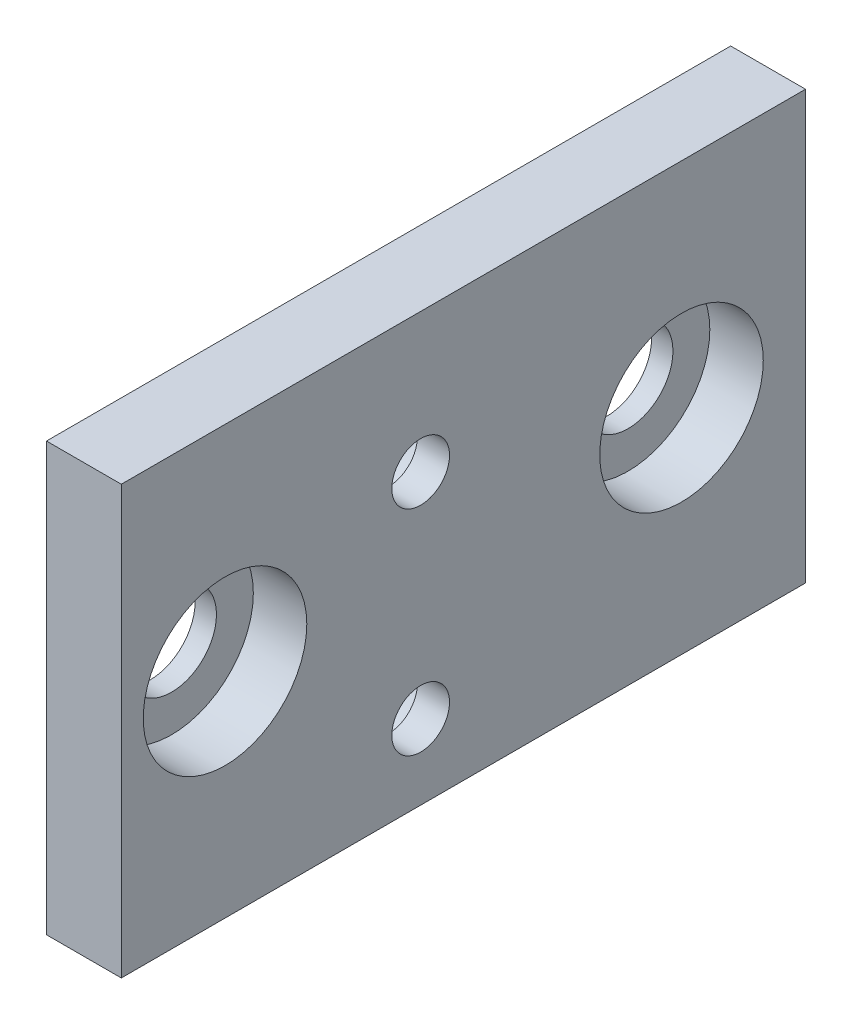
ISO-10303-21;
HEADER;
FILE_DESCRIPTION(('STEP AP214'),'2;1');
FILE_NAME('part.step','',(''),(''),'','','');
FILE_SCHEMA(('AUTOMOTIVE_DESIGN { 1 0 10303 214 1 1 1 1 }'));
ENDSEC;
DATA;
#1=APPLICATION_CONTEXT('core data for automotive mechanical design processes');
#2=APPLICATION_PROTOCOL_DEFINITION('international standard','automotive_design',2000,#1);
#3=PRODUCT_CONTEXT('',#1,'mechanical');
#4=PRODUCT('Part','Part','',(#3));
#5=PRODUCT_RELATED_PRODUCT_CATEGORY('part','',(#4));
#6=PRODUCT_DEFINITION_FORMATION('','',#4);
#7=PRODUCT_DEFINITION_CONTEXT('part definition',#1,'design');
#8=PRODUCT_DEFINITION('design','',#6,#7);
#9=PRODUCT_DEFINITION_SHAPE('','',#8);
#10=(LENGTH_UNIT() NAMED_UNIT(*) SI_UNIT(.MILLI.,.METRE.));
#11=(NAMED_UNIT(*) PLANE_ANGLE_UNIT() SI_UNIT($,.RADIAN.));
#12=(NAMED_UNIT(*) SI_UNIT($,.STERADIAN.) SOLID_ANGLE_UNIT());
#13=UNCERTAINTY_MEASURE_WITH_UNIT(LENGTH_MEASURE(1.E-05),#10,'distance_accuracy_value','');
#14=(GEOMETRIC_REPRESENTATION_CONTEXT(3) GLOBAL_UNCERTAINTY_ASSIGNED_CONTEXT((#13)) GLOBAL_UNIT_ASSIGNED_CONTEXT((#10,
#11,#12)) REPRESENTATION_CONTEXT('',''));
#15=CARTESIAN_POINT('',(0.,0.,0.));
#16=DIRECTION('',(0.,0.,1.));
#17=DIRECTION('',(1.,0.,0.));
#18=AXIS2_PLACEMENT_3D('',#15,#16,#17);
#19=CARTESIAN_POINT('',(0.,0.,16.65));
#20=DIRECTION('',(1.,0.,0.));
#21=DIRECTION('',(0.,0.,-1.));
#22=AXIS2_PLACEMENT_3D('',#19,#20,#21);
#23=CYLINDRICAL_SURFACE('',#22,2.1);
#24=CARTESIAN_POINT('',(0.,0.,16.65));
#25=DIRECTION('',(1.,0.,0.));
#26=DIRECTION('',(0.,0.,-1.));
#27=AXIS2_PLACEMENT_3D('',#24,#25,#26);
#28=CIRCLE('',#27,2.1);
#29=CARTESIAN_POINT('',(0.,0.,14.55));
#30=VERTEX_POINT('',#29);
#31=EDGE_CURVE('E101',#30,#30,#28,.T.);
#32=ORIENTED_EDGE('',*,*,#31,.F.);
#33=EDGE_LOOP('',(#32));
#34=FACE_BOUND('',#33,.T.);
#35=CARTESIAN_POINT('',(1.,0.,16.65));
#36=DIRECTION('',(1.,0.,0.));
#37=DIRECTION('',(0.,0.,-1.));
#38=AXIS2_PLACEMENT_3D('',#35,#36,#37);
#39=CIRCLE('',#38,2.1);
#40=CARTESIAN_POINT('',(1.,0.,14.55));
#41=VERTEX_POINT('',#40);
#42=EDGE_CURVE('E36',#41,#41,#39,.F.);
#43=ORIENTED_EDGE('',*,*,#42,.F.);
#44=EDGE_LOOP('',(#43));
#45=FACE_BOUND('',#44,.T.);
#46=ADVANCED_FACE('F32',(#34,#45),#23,.F.);
#47=CARTESIAN_POINT('',(0.,-6.5,7.5));
#48=DIRECTION('',(1.,0.,0.));
#49=DIRECTION('',(0.,0.,-1.));
#50=AXIS2_PLACEMENT_3D('',#47,#48,#49);
#51=CYLINDRICAL_SURFACE('',#50,1.35);
#52=CARTESIAN_POINT('',(2.,-6.5,7.5));
#53=DIRECTION('',(-1.,0.,0.));
#54=DIRECTION('',(0.,0.,1.));
#55=AXIS2_PLACEMENT_3D('',#52,#53,#54);
#56=CIRCLE('',#55,1.35);
#57=CARTESIAN_POINT('',(2.,-6.5,8.85));
#58=VERTEX_POINT('',#57);
#59=EDGE_CURVE('E121',#58,#58,#56,.F.);
#60=ORIENTED_EDGE('',*,*,#59,.F.);
#61=EDGE_LOOP('',(#60));
#62=FACE_BOUND('',#61,.T.);
#63=CARTESIAN_POINT('',(3.5,-6.5,7.5));
#64=DIRECTION('',(1.,0.,0.));
#65=DIRECTION('',(0.,0.,-1.));
#66=AXIS2_PLACEMENT_3D('',#63,#64,#65);
#67=CIRCLE('',#66,1.35);
#68=CARTESIAN_POINT('',(3.5,-6.5,6.15));
#69=VERTEX_POINT('',#68);
#70=EDGE_CURVE('E199',#69,#69,#67,.T.);
#71=ORIENTED_EDGE('',*,*,#70,.T.);
#72=EDGE_LOOP('',(#71));
#73=FACE_BOUND('',#72,.T.);
#74=ADVANCED_FACE('F164',(#62,#73),#51,.F.);
#75=CARTESIAN_POINT('',(0.,3.5,7.5));
#76=DIRECTION('',(1.,0.,0.));
#77=DIRECTION('',(0.,0.,-1.));
#78=AXIS2_PLACEMENT_3D('',#75,#76,#77);
#79=CYLINDRICAL_SURFACE('',#78,1.35);
#80=CARTESIAN_POINT('',(2.,3.5,7.5));
#81=DIRECTION('',(-1.,0.,0.));
#82=DIRECTION('',(0.,0.,1.));
#83=AXIS2_PLACEMENT_3D('',#80,#81,#82);
#84=CIRCLE('',#83,1.35);
#85=CARTESIAN_POINT('',(2.,3.5,8.85));
#86=VERTEX_POINT('',#85);
#87=EDGE_CURVE('E127',#86,#86,#84,.F.);
#88=ORIENTED_EDGE('',*,*,#87,.F.);
#89=EDGE_LOOP('',(#88));
#90=FACE_BOUND('',#89,.T.);
#91=CARTESIAN_POINT('',(3.5,3.5,7.5));
#92=DIRECTION('',(1.,0.,0.));
#93=DIRECTION('',(0.,0.,-1.));
#94=AXIS2_PLACEMENT_3D('',#91,#92,#93);
#95=CIRCLE('',#94,1.35);
#96=CARTESIAN_POINT('',(3.5,3.5,6.15));
#97=VERTEX_POINT('',#96);
#98=EDGE_CURVE('E92',#97,#97,#95,.T.);
#99=ORIENTED_EDGE('',*,*,#98,.T.);
#100=EDGE_LOOP('',(#99));
#101=FACE_BOUND('',#100,.T.);
#102=ADVANCED_FACE('F170',(#90,#101),#79,.F.);
#103=CARTESIAN_POINT('',(5.,-10.,-10.5));
#104=DIRECTION('',(0.,0.,1.));
#105=DIRECTION('',(1.,0.,0.));
#106=AXIS2_PLACEMENT_3D('',#103,#104,#105);
#107=PLANE('',#106);
#108=DIRECTION('',(-1.,0.,0.));
#109=VECTOR('',#108,1.);
#110=CARTESIAN_POINT('',(5.,10.,-10.5));
#111=LINE('',#110,#109);
#112=CARTESIAN_POINT('',(3.5,10.,-10.5));
#113=VERTEX_POINT('',#112);
#114=CARTESIAN_POINT('',(0.,10.,-10.5));
#115=VERTEX_POINT('',#114);
#116=EDGE_CURVE('E11',#113,#115,#111,.T.);
#117=ORIENTED_EDGE('',*,*,#116,.F.);
#118=DIRECTION('',(0.,1.,0.));
#119=VECTOR('',#118,1.);
#120=CARTESIAN_POINT('',(3.5,-10.,-10.5));
#121=LINE('',#120,#119);
#122=CARTESIAN_POINT('',(3.5,-10.,-10.5));
#123=VERTEX_POINT('',#122);
#124=EDGE_CURVE('E71',#123,#113,#121,.T.);
#125=ORIENTED_EDGE('',*,*,#124,.F.);
#126=DIRECTION('',(-1.,0.,0.));
#127=VECTOR('',#126,1.);
#128=CARTESIAN_POINT('',(5.,-10.,-10.5));
#129=LINE('',#128,#127);
#130=CARTESIAN_POINT('',(0.,-10.,-10.5));
#131=VERTEX_POINT('',#130);
#132=EDGE_CURVE('E41',#123,#131,#129,.T.);
#133=ORIENTED_EDGE('',*,*,#132,.T.);
#134=DIRECTION('',(0.,1.,0.));
#135=VECTOR('',#134,1.);
#136=CARTESIAN_POINT('',(0.,-10.,-10.5));
#137=LINE('',#136,#135);
#138=EDGE_CURVE('E73',#131,#115,#137,.T.);
#139=ORIENTED_EDGE('',*,*,#138,.T.);
#140=EDGE_LOOP('',(#117,#125,#133,#139));
#141=FACE_BOUND('',#140,.T.);
#142=ADVANCED_FACE('F34',(#141),#107,.F.);
#143=CARTESIAN_POINT('',(5.,10.,10.5));
#144=DIRECTION('',(0.,-1.,0.));
#145=DIRECTION('',(0.,0.,-1.));
#146=AXIS2_PLACEMENT_3D('',#143,#144,#145);
#147=PLANE('',#146);
#148=DIRECTION('',(-1.,0.,0.));
#149=VECTOR('',#148,1.);
#150=CARTESIAN_POINT('',(3.,10.,21.5));
#151=LINE('',#150,#149);
#152=CARTESIAN_POINT('',(3.5,10.,21.5));
#153=VERTEX_POINT('',#152);
#154=CARTESIAN_POINT('',(0.,10.,21.5));
#155=VERTEX_POINT('',#154);
#156=EDGE_CURVE('E78',#153,#155,#151,.T.);
#157=ORIENTED_EDGE('',*,*,#156,.F.);
#158=DIRECTION('',(0.,0.,1.));
#159=VECTOR('',#158,1.);
#160=CARTESIAN_POINT('',(3.5,10.,-10.5));
#161=LINE('',#160,#159);
#162=EDGE_CURVE('E75',#113,#153,#161,.T.);
#163=ORIENTED_EDGE('',*,*,#162,.F.);
#164=ORIENTED_EDGE('',*,*,#116,.T.);
#165=DIRECTION('',(0.,0.,1.));
#166=VECTOR('',#165,1.);
#167=CARTESIAN_POINT('',(0.,10.,10.5));
#168=LINE('',#167,#166);
#169=EDGE_CURVE('E132',#115,#155,#168,.T.);
#170=ORIENTED_EDGE('',*,*,#169,.T.);
#171=EDGE_LOOP('',(#157,#163,#164,#170));
#172=FACE_BOUND('',#171,.T.);
#173=ADVANCED_FACE('F76',(#172),#147,.F.);
#174=CARTESIAN_POINT('',(5.,-10.,10.5));
#175=DIRECTION('',(0.,1.,0.));
#176=DIRECTION('',(0.,0.,1.));
#177=AXIS2_PLACEMENT_3D('',#174,#175,#176);
#178=PLANE('',#177);
#179=ORIENTED_EDGE('',*,*,#132,.F.);
#180=DIRECTION('',(0.,0.,-1.));
#181=VECTOR('',#180,1.);
#182=CARTESIAN_POINT('',(3.5,-10.,21.5));
#183=LINE('',#182,#181);
#184=CARTESIAN_POINT('',(3.5,-10.,21.5));
#185=VERTEX_POINT('',#184);
#186=EDGE_CURVE('E88',#185,#123,#183,.T.);
#187=ORIENTED_EDGE('',*,*,#186,.F.);
#188=DIRECTION('',(1.,0.,0.));
#189=VECTOR('',#188,1.);
#190=CARTESIAN_POINT('',(0.,-10.,21.5));
#191=LINE('',#190,#189);
#192=CARTESIAN_POINT('',(0.,-10.,21.5));
#193=VERTEX_POINT('',#192);
#194=EDGE_CURVE('E104',#193,#185,#191,.T.);
#195=ORIENTED_EDGE('',*,*,#194,.F.);
#196=DIRECTION('',(0.,0.,-1.));
#197=VECTOR('',#196,1.);
#198=CARTESIAN_POINT('',(0.,-10.,10.5));
#199=LINE('',#198,#197);
#200=EDGE_CURVE('E134',#193,#131,#199,.T.);
#201=ORIENTED_EDGE('',*,*,#200,.T.);
#202=EDGE_LOOP('',(#179,#187,#195,#201));
#203=FACE_BOUND('',#202,.T.);
#204=ADVANCED_FACE('F158',(#203),#178,.F.);
#205=CARTESIAN_POINT('',(1.,0.,-4.7));
#206=DIRECTION('',(1.,0.,0.));
#207=DIRECTION('',(0.,0.,-1.));
#208=AXIS2_PLACEMENT_3D('',#205,#206,#207);
#209=CYLINDRICAL_SURFACE('',#208,3.825);
#210=CARTESIAN_POINT('',(1.,0.,-4.7));
#211=DIRECTION('',(1.,0.,0.));
#212=DIRECTION('',(0.,0.,-1.));
#213=AXIS2_PLACEMENT_3D('',#210,#211,#212);
#214=CIRCLE('',#213,3.825);
#215=CARTESIAN_POINT('',(1.,0.,-8.525));
#216=VERTEX_POINT('',#215);
#217=EDGE_CURVE('E110',#216,#216,#214,.T.);
#218=ORIENTED_EDGE('',*,*,#217,.F.);
#219=EDGE_LOOP('',(#218));
#220=FACE_BOUND('',#219,.T.);
#221=CARTESIAN_POINT('',(3.5,0.,-4.7));
#222=DIRECTION('',(1.,0.,0.));
#223=DIRECTION('',(0.,0.,-1.));
#224=AXIS2_PLACEMENT_3D('',#221,#222,#223);
#225=CIRCLE('',#224,3.825);
#226=CARTESIAN_POINT('',(3.5,0.,-8.525));
#227=VERTEX_POINT('',#226);
#228=EDGE_CURVE('E197',#227,#227,#225,.T.);
#229=ORIENTED_EDGE('',*,*,#228,.T.);
#230=EDGE_LOOP('',(#229));
#231=FACE_BOUND('',#230,.T.);
#232=ADVANCED_FACE('F148',(#220,#231),#209,.F.);
#233=CARTESIAN_POINT('',(0.,0.,-4.7));
#234=DIRECTION('',(1.,0.,0.));
#235=DIRECTION('',(0.,0.,-1.));
#236=AXIS2_PLACEMENT_3D('',#233,#234,#235);
#237=CYLINDRICAL_SURFACE('',#236,2.1);
#238=CARTESIAN_POINT('',(0.,0.,-4.7));
#239=DIRECTION('',(1.,0.,0.));
#240=DIRECTION('',(0.,0.,-1.));
#241=AXIS2_PLACEMENT_3D('',#238,#239,#240);
#242=CIRCLE('',#241,2.1);
#243=CARTESIAN_POINT('',(0.,0.,-6.8));
#244=VERTEX_POINT('',#243);
#245=EDGE_CURVE('E114',#244,#244,#242,.T.);
#246=ORIENTED_EDGE('',*,*,#245,.F.);
#247=EDGE_LOOP('',(#246));
#248=FACE_BOUND('',#247,.T.);
#249=CARTESIAN_POINT('',(1.,0.,-4.7));
#250=DIRECTION('',(1.,0.,0.));
#251=DIRECTION('',(0.,0.,-1.));
#252=AXIS2_PLACEMENT_3D('',#249,#250,#251);
#253=CIRCLE('',#252,2.1);
#254=CARTESIAN_POINT('',(1.,0.,-6.8));
#255=VERTEX_POINT('',#254);
#256=EDGE_CURVE('E113',#255,#255,#253,.F.);
#257=ORIENTED_EDGE('',*,*,#256,.F.);
#258=EDGE_LOOP('',(#257));
#259=FACE_BOUND('',#258,.T.);
#260=ADVANCED_FACE('F145',(#248,#259),#237,.F.);
#261=CARTESIAN_POINT('',(0.,0.,0.));
#262=DIRECTION('',(-1.,0.,0.));
#263=DIRECTION('',(0.,0.,1.));
#264=AXIS2_PLACEMENT_3D('',#261,#262,#263);
#265=PLANE('',#264);
#266=ORIENTED_EDGE('',*,*,#31,.T.);
#267=EDGE_LOOP('',(#266));
#268=FACE_BOUND('',#267,.T.);
#269=ORIENTED_EDGE('',*,*,#245,.T.);
#270=EDGE_LOOP('',(#269));
#271=FACE_BOUND('',#270,.T.);
#272=CARTESIAN_POINT('',(0.,-6.5,7.5));
#273=DIRECTION('',(-1.,0.,0.));
#274=DIRECTION('',(0.,0.,1.));
#275=AXIS2_PLACEMENT_3D('',#272,#273,#274);
#276=CIRCLE('',#275,2.5);
#277=CARTESIAN_POINT('',(0.,-6.5,10.));
#278=VERTEX_POINT('',#277);
#279=EDGE_CURVE('E117',#278,#278,#276,.T.);
#280=ORIENTED_EDGE('',*,*,#279,.F.);
#281=EDGE_LOOP('',(#280));
#282=FACE_BOUND('',#281,.T.);
#283=CARTESIAN_POINT('',(0.,3.5,7.5));
#284=DIRECTION('',(-1.,0.,0.));
#285=DIRECTION('',(0.,0.,1.));
#286=AXIS2_PLACEMENT_3D('',#283,#284,#285);
#287=CIRCLE('',#286,2.5);
#288=CARTESIAN_POINT('',(0.,3.5,10.));
#289=VERTEX_POINT('',#288);
#290=EDGE_CURVE('E128',#289,#289,#287,.T.);
#291=ORIENTED_EDGE('',*,*,#290,.F.);
#292=EDGE_LOOP('',(#291));
#293=FACE_BOUND('',#292,.T.);
#294=ORIENTED_EDGE('',*,*,#138,.F.);
#295=ORIENTED_EDGE('',*,*,#200,.F.);
#296=DIRECTION('',(0.,-1.,0.));
#297=VECTOR('',#296,1.);
#298=CARTESIAN_POINT('',(0.,10.,21.5));
#299=LINE('',#298,#297);
#300=EDGE_CURVE('E107',#155,#193,#299,.T.);
#301=ORIENTED_EDGE('',*,*,#300,.F.);
#302=ORIENTED_EDGE('',*,*,#169,.F.);
#303=EDGE_LOOP('',(#294,#295,#301,#302));
#304=FACE_BOUND('',#303,.T.);
#305=ADVANCED_FACE('F147',(#268,#271,#282,#293,#304),#265,.T.);
#306=CARTESIAN_POINT('',(2.,3.5,7.5));
#307=DIRECTION('',(-1.,0.,0.));
#308=DIRECTION('',(0.,0.,1.));
#309=AXIS2_PLACEMENT_3D('',#306,#307,#308);
#310=PLANE('',#309);
#311=CARTESIAN_POINT('',(2.,3.5,7.5));
#312=DIRECTION('',(-1.,0.,0.));
#313=DIRECTION('',(0.,0.,1.));
#314=AXIS2_PLACEMENT_3D('',#311,#312,#313);
#315=CIRCLE('',#314,2.5);
#316=CARTESIAN_POINT('',(2.,3.5,10.));
#317=VERTEX_POINT('',#316);
#318=EDGE_CURVE('E124',#317,#317,#315,.T.);
#319=ORIENTED_EDGE('',*,*,#318,.T.);
#320=EDGE_LOOP('',(#319));
#321=FACE_BOUND('',#320,.T.);
#322=ORIENTED_EDGE('',*,*,#87,.T.);
#323=EDGE_LOOP('',(#322));
#324=FACE_BOUND('',#323,.T.);
#325=ADVANCED_FACE('F155',(#321,#324),#310,.T.);
#326=CARTESIAN_POINT('',(2.,3.5,7.5));
#327=DIRECTION('',(-1.,0.,0.));
#328=DIRECTION('',(0.,0.,1.));
#329=AXIS2_PLACEMENT_3D('',#326,#327,#328);
#330=CYLINDRICAL_SURFACE('',#329,2.5);
#331=ORIENTED_EDGE('',*,*,#318,.F.);
#332=EDGE_LOOP('',(#331));
#333=FACE_BOUND('',#332,.T.);
#334=ORIENTED_EDGE('',*,*,#290,.T.);
#335=EDGE_LOOP('',(#334));
#336=FACE_BOUND('',#335,.T.);
#337=ADVANCED_FACE('F351',(#333,#336),#330,.F.);
#338=CARTESIAN_POINT('',(2.,-6.5,7.5));
#339=DIRECTION('',(-1.,0.,0.));
#340=DIRECTION('',(0.,0.,1.));
#341=AXIS2_PLACEMENT_3D('',#338,#339,#340);
#342=PLANE('',#341);
#343=CARTESIAN_POINT('',(2.,-6.5,7.5));
#344=DIRECTION('',(-1.,0.,0.));
#345=DIRECTION('',(0.,0.,1.));
#346=AXIS2_PLACEMENT_3D('',#343,#344,#345);
#347=CIRCLE('',#346,2.5);
#348=CARTESIAN_POINT('',(2.,-6.5,10.));
#349=VERTEX_POINT('',#348);
#350=EDGE_CURVE('E118',#349,#349,#347,.T.);
#351=ORIENTED_EDGE('',*,*,#350,.T.);
#352=EDGE_LOOP('',(#351));
#353=FACE_BOUND('',#352,.T.);
#354=ORIENTED_EDGE('',*,*,#59,.T.);
#355=EDGE_LOOP('',(#354));
#356=FACE_BOUND('',#355,.T.);
#357=ADVANCED_FACE('F190',(#353,#356),#342,.T.);
#358=CARTESIAN_POINT('',(2.,-6.5,7.5));
#359=DIRECTION('',(-1.,0.,0.));
#360=DIRECTION('',(0.,0.,1.));
#361=AXIS2_PLACEMENT_3D('',#358,#359,#360);
#362=CYLINDRICAL_SURFACE('',#361,2.5);
#363=ORIENTED_EDGE('',*,*,#350,.F.);
#364=EDGE_LOOP('',(#363));
#365=FACE_BOUND('',#364,.T.);
#366=ORIENTED_EDGE('',*,*,#279,.T.);
#367=EDGE_LOOP('',(#366));
#368=FACE_BOUND('',#367,.T.);
#369=ADVANCED_FACE('F185',(#365,#368),#362,.F.);
#370=CARTESIAN_POINT('',(1.,0.,-4.7));
#371=DIRECTION('',(1.,0.,0.));
#372=DIRECTION('',(0.,0.,-1.));
#373=AXIS2_PLACEMENT_3D('',#370,#371,#372);
#374=PLANE('',#373);
#375=ORIENTED_EDGE('',*,*,#217,.T.);
#376=EDGE_LOOP('',(#375));
#377=FACE_BOUND('',#376,.T.);
#378=ORIENTED_EDGE('',*,*,#256,.T.);
#379=EDGE_LOOP('',(#378));
#380=FACE_BOUND('',#379,.T.);
#381=ADVANCED_FACE('F143',(#377,#380),#374,.T.);
#382=CARTESIAN_POINT('',(0.,0.,21.5));
#383=DIRECTION('',(0.,0.,1.));
#384=DIRECTION('',(1.,0.,0.));
#385=AXIS2_PLACEMENT_3D('',#382,#383,#384);
#386=PLANE('',#385);
#387=ORIENTED_EDGE('',*,*,#194,.T.);
#388=DIRECTION('',(0.,-1.,0.));
#389=VECTOR('',#388,1.);
#390=CARTESIAN_POINT('',(3.5,10.,21.5));
#391=LINE('',#390,#389);
#392=EDGE_CURVE('E82',#153,#185,#391,.T.);
#393=ORIENTED_EDGE('',*,*,#392,.F.);
#394=ORIENTED_EDGE('',*,*,#156,.T.);
#395=ORIENTED_EDGE('',*,*,#300,.T.);
#396=EDGE_LOOP('',(#387,#393,#394,#395));
#397=FACE_BOUND('',#396,.T.);
#398=ADVANCED_FACE('F179',(#397),#386,.T.);
#399=CARTESIAN_POINT('',(1.,0.,16.65));
#400=DIRECTION('',(1.,0.,0.));
#401=DIRECTION('',(0.,0.,-1.));
#402=AXIS2_PLACEMENT_3D('',#399,#400,#401);
#403=PLANE('',#402);
#404=CARTESIAN_POINT('',(1.,0.,16.65));
#405=DIRECTION('',(1.,0.,0.));
#406=DIRECTION('',(0.,0.,-1.));
#407=AXIS2_PLACEMENT_3D('',#404,#405,#406);
#408=CIRCLE('',#407,3.825);
#409=CARTESIAN_POINT('',(1.,0.,12.825));
#410=VERTEX_POINT('',#409);
#411=EDGE_CURVE('E98',#410,#410,#408,.T.);
#412=ORIENTED_EDGE('',*,*,#411,.T.);
#413=EDGE_LOOP('',(#412));
#414=FACE_BOUND('',#413,.T.);
#415=ORIENTED_EDGE('',*,*,#42,.T.);
#416=EDGE_LOOP('',(#415));
#417=FACE_BOUND('',#416,.T.);
#418=ADVANCED_FACE('F182',(#414,#417),#403,.T.);
#419=CARTESIAN_POINT('',(1.,0.,16.65));
#420=DIRECTION('',(1.,0.,0.));
#421=DIRECTION('',(0.,0.,-1.));
#422=AXIS2_PLACEMENT_3D('',#419,#420,#421);
#423=CYLINDRICAL_SURFACE('',#422,3.825);
#424=ORIENTED_EDGE('',*,*,#411,.F.);
#425=EDGE_LOOP('',(#424));
#426=FACE_BOUND('',#425,.T.);
#427=CARTESIAN_POINT('',(3.5,0.,16.65));
#428=DIRECTION('',(1.,0.,0.));
#429=DIRECTION('',(0.,0.,-1.));
#430=AXIS2_PLACEMENT_3D('',#427,#428,#429);
#431=CIRCLE('',#430,3.825);
#432=CARTESIAN_POINT('',(3.5,0.,12.825));
#433=VERTEX_POINT('',#432);
#434=EDGE_CURVE('E89',#433,#433,#431,.T.);
#435=ORIENTED_EDGE('',*,*,#434,.T.);
#436=EDGE_LOOP('',(#435));
#437=FACE_BOUND('',#436,.T.);
#438=ADVANCED_FACE('F177',(#426,#437),#423,.F.);
#439=CARTESIAN_POINT('',(3.5,0.,0.));
#440=DIRECTION('',(1.,0.,0.));
#441=DIRECTION('',(0.,0.,-1.));
#442=AXIS2_PLACEMENT_3D('',#439,#440,#441);
#443=PLANE('',#442);
#444=ORIENTED_EDGE('',*,*,#70,.F.);
#445=EDGE_LOOP('',(#444));
#446=FACE_BOUND('',#445,.T.);
#447=ORIENTED_EDGE('',*,*,#434,.F.);
#448=EDGE_LOOP('',(#447));
#449=FACE_BOUND('',#448,.T.);
#450=ORIENTED_EDGE('',*,*,#124,.T.);
#451=ORIENTED_EDGE('',*,*,#162,.T.);
#452=ORIENTED_EDGE('',*,*,#392,.T.);
#453=ORIENTED_EDGE('',*,*,#186,.T.);
#454=EDGE_LOOP('',(#450,#451,#452,#453));
#455=FACE_BOUND('',#454,.T.);
#456=ORIENTED_EDGE('',*,*,#98,.F.);
#457=EDGE_LOOP('',(#456));
#458=FACE_BOUND('',#457,.T.);
#459=ORIENTED_EDGE('',*,*,#228,.F.);
#460=EDGE_LOOP('',(#459));
#461=FACE_BOUND('',#460,.T.);
#462=ADVANCED_FACE('F85',(#446,#449,#455,#458,#461),#443,.T.);
#463=CLOSED_SHELL('',(#46,#74,#102,#142,#173,#204,#232,#260,#305,#325,#337,#357,#369,#381,#398,
#418,#438,#462));
#464=MANIFOLD_SOLID_BREP('B2',#463);
#465=ADVANCED_BREP_SHAPE_REPRESENTATION('',(#18,#464),#14);
#466=SHAPE_DEFINITION_REPRESENTATION(#9,#465);
ENDSEC;
END-ISO-10303-21;
